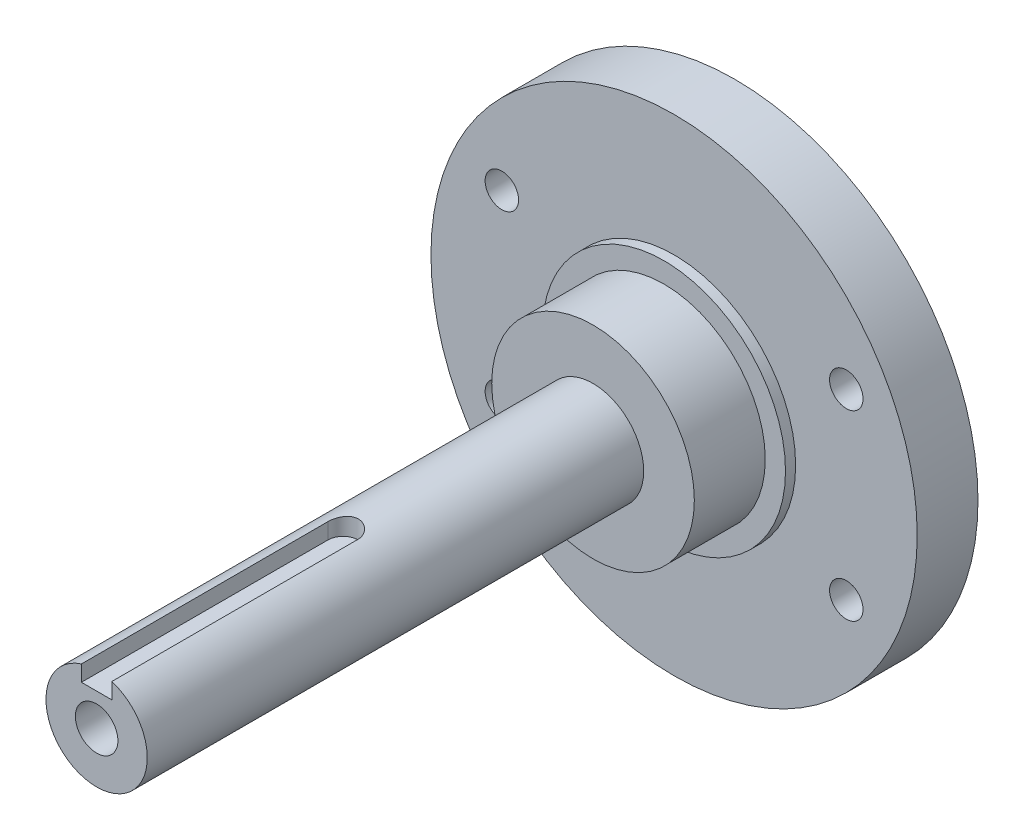
ISO-10303-21;
HEADER;
FILE_DESCRIPTION(('STEP AP214'),'2;1');
FILE_NAME('part.step','',(''),(''),'','','');
FILE_SCHEMA(('AUTOMOTIVE_DESIGN { 1 0 10303 214 1 1 1 1 }'));
ENDSEC;
DATA;
#1=APPLICATION_CONTEXT('core data for automotive mechanical design processes');
#2=APPLICATION_PROTOCOL_DEFINITION('international standard','automotive_design',2000,#1);
#3=PRODUCT_CONTEXT('',#1,'mechanical');
#4=PRODUCT('Part','Part','',(#3));
#5=PRODUCT_RELATED_PRODUCT_CATEGORY('part','',(#4));
#6=PRODUCT_DEFINITION_FORMATION('','',#4);
#7=PRODUCT_DEFINITION_CONTEXT('part definition',#1,'design');
#8=PRODUCT_DEFINITION('design','',#6,#7);
#9=PRODUCT_DEFINITION_SHAPE('','',#8);
#10=(LENGTH_UNIT() NAMED_UNIT(*) SI_UNIT(.MILLI.,.METRE.));
#11=(NAMED_UNIT(*) PLANE_ANGLE_UNIT() SI_UNIT($,.RADIAN.));
#12=(NAMED_UNIT(*) SI_UNIT($,.STERADIAN.) SOLID_ANGLE_UNIT());
#13=UNCERTAINTY_MEASURE_WITH_UNIT(LENGTH_MEASURE(1.E-05),#10,'distance_accuracy_value','');
#14=(GEOMETRIC_REPRESENTATION_CONTEXT(3) GLOBAL_UNCERTAINTY_ASSIGNED_CONTEXT((#13)) GLOBAL_UNIT_ASSIGNED_CONTEXT((#10,
#11,#12)) REPRESENTATION_CONTEXT('',''));
#15=CARTESIAN_POINT('',(0.,0.,0.));
#16=DIRECTION('',(0.,0.,1.));
#17=DIRECTION('',(1.,0.,0.));
#18=AXIS2_PLACEMENT_3D('',#15,#16,#17);
#19=CARTESIAN_POINT('',(0.,0.,1.));
#20=DIRECTION('',(0.,0.,-1.));
#21=DIRECTION('',(-1.,0.,0.));
#22=AXIS2_PLACEMENT_3D('',#19,#20,#21);
#23=CYLINDRICAL_SURFACE('',#22,12.);
#24=CARTESIAN_POINT('',(0.,0.,1.));
#25=DIRECTION('',(0.,0.,1.));
#26=DIRECTION('',(1.,0.,0.));
#27=AXIS2_PLACEMENT_3D('',#24,#25,#26);
#28=CIRCLE('',#27,12.);
#29=CARTESIAN_POINT('',(12.,0.,1.));
#30=VERTEX_POINT('',#29);
#31=EDGE_CURVE('E82',#30,#30,#28,.T.);
#32=ORIENTED_EDGE('',*,*,#31,.F.);
#33=EDGE_LOOP('',(#32));
#34=FACE_BOUND('',#33,.T.);
#35=CARTESIAN_POINT('',(0.,0.,0.));
#36=DIRECTION('',(0.,0.,1.));
#37=DIRECTION('',(1.,0.,0.));
#38=AXIS2_PLACEMENT_3D('',#35,#36,#37);
#39=CIRCLE('',#38,12.);
#40=CARTESIAN_POINT('',(12.,0.,0.));
#41=VERTEX_POINT('',#40);
#42=EDGE_CURVE('E144',#41,#41,#39,.T.);
#43=ORIENTED_EDGE('',*,*,#42,.T.);
#44=EDGE_LOOP('',(#43));
#45=FACE_BOUND('',#44,.T.);
#46=ADVANCED_FACE('F33',(#34,#45),#23,.T.);
#47=CARTESIAN_POINT('',(0.,0.,1.));
#48=DIRECTION('',(0.,0.,1.));
#49=DIRECTION('',(1.,0.,0.));
#50=AXIS2_PLACEMENT_3D('',#47,#48,#49);
#51=PLANE('',#50);
#52=CARTESIAN_POINT('',(0.,0.,1.));
#53=DIRECTION('',(0.,0.,1.));
#54=DIRECTION('',(1.,0.,0.));
#55=AXIS2_PLACEMENT_3D('',#52,#53,#54);
#56=CIRCLE('',#55,10.);
#57=CARTESIAN_POINT('',(9.99999999999999,0.,1.));
#58=VERTEX_POINT('',#57);
#59=EDGE_CURVE('E195',#58,#58,#56,.T.);
#60=ORIENTED_EDGE('',*,*,#59,.F.);
#61=EDGE_LOOP('',(#60));
#62=FACE_BOUND('',#61,.T.);
#63=ORIENTED_EDGE('',*,*,#31,.T.);
#64=EDGE_LOOP('',(#63));
#65=FACE_BOUND('',#64,.T.);
#66=ADVANCED_FACE('F132',(#62,#65),#51,.T.);
#67=CARTESIAN_POINT('',(0.,0.,-6.));
#68=DIRECTION('',(0.,0.,1.));
#69=DIRECTION('',(1.,0.,0.));
#70=AXIS2_PLACEMENT_3D('',#67,#68,#69);
#71=CYLINDRICAL_SURFACE('',#70,24.);
#72=CARTESIAN_POINT('',(0.,0.,-6.));
#73=DIRECTION('',(0.,0.,-1.));
#74=DIRECTION('',(-1.,0.,0.));
#75=AXIS2_PLACEMENT_3D('',#72,#73,#74);
#76=CIRCLE('',#75,24.);
#77=CARTESIAN_POINT('',(-24.,0.,-6.));
#78=VERTEX_POINT('',#77);
#79=EDGE_CURVE('E146',#78,#78,#76,.T.);
#80=ORIENTED_EDGE('',*,*,#79,.F.);
#81=EDGE_LOOP('',(#80));
#82=FACE_BOUND('',#81,.T.);
#83=CARTESIAN_POINT('',(0.,0.,0.));
#84=DIRECTION('',(0.,0.,-1.));
#85=DIRECTION('',(-1.,0.,0.));
#86=AXIS2_PLACEMENT_3D('',#83,#84,#85);
#87=CIRCLE('',#86,24.);
#88=CARTESIAN_POINT('',(-24.,0.,0.));
#89=VERTEX_POINT('',#88);
#90=EDGE_CURVE('E150',#89,#89,#87,.T.);
#91=ORIENTED_EDGE('',*,*,#90,.T.);
#92=EDGE_LOOP('',(#91));
#93=FACE_BOUND('',#92,.T.);
#94=ADVANCED_FACE('F137',(#82,#93),#71,.T.);
#95=CARTESIAN_POINT('',(0.,0.,-6.));
#96=DIRECTION('',(0.,0.,-1.));
#97=DIRECTION('',(-1.,0.,0.));
#98=AXIS2_PLACEMENT_3D('',#95,#96,#97);
#99=PLANE('',#98);
#100=CARTESIAN_POINT('',(17.,8.99999999999999,-6.));
#101=DIRECTION('',(0.,0.,-1.));
#102=DIRECTION('',(-1.,0.,0.));
#103=AXIS2_PLACEMENT_3D('',#100,#101,#102);
#104=CIRCLE('',#103,1.65);
#105=CARTESIAN_POINT('',(15.35,8.99999999999999,-6.));
#106=VERTEX_POINT('',#105);
#107=EDGE_CURVE('E176',#106,#106,#104,.T.);
#108=ORIENTED_EDGE('',*,*,#107,.F.);
#109=EDGE_LOOP('',(#108));
#110=FACE_BOUND('',#109,.T.);
#111=CARTESIAN_POINT('',(-17.,-9.,-6.));
#112=DIRECTION('',(0.,0.,-1.));
#113=DIRECTION('',(-1.,0.,0.));
#114=AXIS2_PLACEMENT_3D('',#111,#112,#113);
#115=CIRCLE('',#114,1.65);
#116=CARTESIAN_POINT('',(-18.65,-9.,-6.));
#117=VERTEX_POINT('',#116);
#118=EDGE_CURVE('E170',#117,#117,#115,.T.);
#119=ORIENTED_EDGE('',*,*,#118,.F.);
#120=EDGE_LOOP('',(#119));
#121=FACE_BOUND('',#120,.T.);
#122=CARTESIAN_POINT('',(-17.,9.,-6.));
#123=DIRECTION('',(0.,0.,-1.));
#124=DIRECTION('',(-1.,0.,0.));
#125=AXIS2_PLACEMENT_3D('',#122,#123,#124);
#126=CIRCLE('',#125,1.65);
#127=CARTESIAN_POINT('',(-18.65,9.,-6.));
#128=VERTEX_POINT('',#127);
#129=EDGE_CURVE('E164',#128,#128,#126,.T.);
#130=ORIENTED_EDGE('',*,*,#129,.F.);
#131=EDGE_LOOP('',(#130));
#132=FACE_BOUND('',#131,.T.);
#133=CARTESIAN_POINT('',(17.,-9.00000000000001,-6.));
#134=DIRECTION('',(0.,0.,-1.));
#135=DIRECTION('',(-1.,0.,0.));
#136=AXIS2_PLACEMENT_3D('',#133,#134,#135);
#137=CIRCLE('',#136,1.65);
#138=CARTESIAN_POINT('',(15.35,-9.00000000000001,-6.));
#139=VERTEX_POINT('',#138);
#140=EDGE_CURVE('E158',#139,#139,#137,.T.);
#141=ORIENTED_EDGE('',*,*,#140,.F.);
#142=EDGE_LOOP('',(#141));
#143=FACE_BOUND('',#142,.T.);
#144=ORIENTED_EDGE('',*,*,#79,.T.);
#145=EDGE_LOOP('',(#144));
#146=FACE_BOUND('',#145,.T.);
#147=ADVANCED_FACE('F270',(#110,#121,#132,#143,#146),#99,.T.);
#148=CARTESIAN_POINT('',(0.,0.,0.));
#149=DIRECTION('',(0.,0.,-1.));
#150=DIRECTION('',(-1.,0.,0.));
#151=AXIS2_PLACEMENT_3D('',#148,#149,#150);
#152=PLANE('',#151);
#153=CARTESIAN_POINT('',(17.,8.99999999999999,0.));
#154=DIRECTION('',(0.,0.,-1.));
#155=DIRECTION('',(-1.,0.,0.));
#156=AXIS2_PLACEMENT_3D('',#153,#154,#155);
#157=CIRCLE('',#156,1.65);
#158=CARTESIAN_POINT('',(15.35,8.99999999999999,0.));
#159=VERTEX_POINT('',#158);
#160=EDGE_CURVE('E173',#159,#159,#157,.T.);
#161=ORIENTED_EDGE('',*,*,#160,.T.);
#162=EDGE_LOOP('',(#161));
#163=FACE_BOUND('',#162,.T.);
#164=CARTESIAN_POINT('',(-17.,-9.,0.));
#165=DIRECTION('',(0.,0.,-1.));
#166=DIRECTION('',(-1.,0.,0.));
#167=AXIS2_PLACEMENT_3D('',#164,#165,#166);
#168=CIRCLE('',#167,1.65);
#169=CARTESIAN_POINT('',(-18.65,-9.,0.));
#170=VERTEX_POINT('',#169);
#171=EDGE_CURVE('E167',#170,#170,#168,.T.);
#172=ORIENTED_EDGE('',*,*,#171,.T.);
#173=EDGE_LOOP('',(#172));
#174=FACE_BOUND('',#173,.T.);
#175=CARTESIAN_POINT('',(-17.,9.,0.));
#176=DIRECTION('',(0.,0.,-1.));
#177=DIRECTION('',(-1.,0.,0.));
#178=AXIS2_PLACEMENT_3D('',#175,#176,#177);
#179=CIRCLE('',#178,1.65);
#180=CARTESIAN_POINT('',(-18.65,9.,0.));
#181=VERTEX_POINT('',#180);
#182=EDGE_CURVE('E161',#181,#181,#179,.T.);
#183=ORIENTED_EDGE('',*,*,#182,.T.);
#184=EDGE_LOOP('',(#183));
#185=FACE_BOUND('',#184,.T.);
#186=CARTESIAN_POINT('',(17.,-9.00000000000001,0.));
#187=DIRECTION('',(0.,0.,-1.));
#188=DIRECTION('',(-1.,0.,0.));
#189=AXIS2_PLACEMENT_3D('',#186,#187,#188);
#190=CIRCLE('',#189,1.65);
#191=CARTESIAN_POINT('',(15.35,-9.00000000000001,0.));
#192=VERTEX_POINT('',#191);
#193=EDGE_CURVE('E154',#192,#192,#190,.T.);
#194=ORIENTED_EDGE('',*,*,#193,.T.);
#195=EDGE_LOOP('',(#194));
#196=FACE_BOUND('',#195,.T.);
#197=ORIENTED_EDGE('',*,*,#42,.F.);
#198=EDGE_LOOP('',(#197));
#199=FACE_BOUND('',#198,.T.);
#200=ORIENTED_EDGE('',*,*,#90,.F.);
#201=EDGE_LOOP('',(#200));
#202=FACE_BOUND('',#201,.T.);
#203=ADVANCED_FACE('F277',(#163,#174,#185,#196,#199,#202),#152,.F.);
#204=CARTESIAN_POINT('',(17.,-9.00000000000001,-6.));
#205=DIRECTION('',(0.,0.,-1.));
#206=DIRECTION('',(-1.,0.,0.));
#207=AXIS2_PLACEMENT_3D('',#204,#205,#206);
#208=CYLINDRICAL_SURFACE('',#207,1.65);
#209=ORIENTED_EDGE('',*,*,#193,.F.);
#210=EDGE_LOOP('',(#209));
#211=FACE_BOUND('',#210,.T.);
#212=ORIENTED_EDGE('',*,*,#140,.T.);
#213=EDGE_LOOP('',(#212));
#214=FACE_BOUND('',#213,.T.);
#215=ADVANCED_FACE('F285',(#211,#214),#208,.F.);
#216=CARTESIAN_POINT('',(-17.,9.,-6.));
#217=DIRECTION('',(0.,0.,-1.));
#218=DIRECTION('',(-1.,0.,0.));
#219=AXIS2_PLACEMENT_3D('',#216,#217,#218);
#220=CYLINDRICAL_SURFACE('',#219,1.65);
#221=ORIENTED_EDGE('',*,*,#182,.F.);
#222=EDGE_LOOP('',(#221));
#223=FACE_BOUND('',#222,.T.);
#224=ORIENTED_EDGE('',*,*,#129,.T.);
#225=EDGE_LOOP('',(#224));
#226=FACE_BOUND('',#225,.T.);
#227=ADVANCED_FACE('F293',(#223,#226),#220,.F.);
#228=CARTESIAN_POINT('',(-17.,-9.,-6.));
#229=DIRECTION('',(0.,0.,-1.));
#230=DIRECTION('',(-1.,0.,0.));
#231=AXIS2_PLACEMENT_3D('',#228,#229,#230);
#232=CYLINDRICAL_SURFACE('',#231,1.65);
#233=ORIENTED_EDGE('',*,*,#171,.F.);
#234=EDGE_LOOP('',(#233));
#235=FACE_BOUND('',#234,.T.);
#236=ORIENTED_EDGE('',*,*,#118,.T.);
#237=EDGE_LOOP('',(#236));
#238=FACE_BOUND('',#237,.T.);
#239=ADVANCED_FACE('F301',(#235,#238),#232,.F.);
#240=CARTESIAN_POINT('',(17.,8.99999999999999,-6.));
#241=DIRECTION('',(0.,0.,-1.));
#242=DIRECTION('',(-1.,0.,0.));
#243=AXIS2_PLACEMENT_3D('',#240,#241,#242);
#244=CYLINDRICAL_SURFACE('',#243,1.65);
#245=ORIENTED_EDGE('',*,*,#160,.F.);
#246=EDGE_LOOP('',(#245));
#247=FACE_BOUND('',#246,.T.);
#248=ORIENTED_EDGE('',*,*,#107,.T.);
#249=EDGE_LOOP('',(#248));
#250=FACE_BOUND('',#249,.T.);
#251=ADVANCED_FACE('F213',(#247,#250),#244,.F.);
#252=CARTESIAN_POINT('',(0.,0.,7.99999999999999));
#253=DIRECTION('',(0.,0.,-1.));
#254=DIRECTION('',(-1.,0.,0.));
#255=AXIS2_PLACEMENT_3D('',#252,#253,#254);
#256=CYLINDRICAL_SURFACE('',#255,10.);
#257=CARTESIAN_POINT('',(0.,0.,7.99999999999999));
#258=DIRECTION('',(0.,0.,1.));
#259=DIRECTION('',(1.,0.,0.));
#260=AXIS2_PLACEMENT_3D('',#257,#258,#259);
#261=CIRCLE('',#260,10.);
#262=CARTESIAN_POINT('',(9.99999999999999,0.,7.99999999999999));
#263=VERTEX_POINT('',#262);
#264=EDGE_CURVE('E198',#263,#263,#261,.T.);
#265=ORIENTED_EDGE('',*,*,#264,.F.);
#266=EDGE_LOOP('',(#265));
#267=FACE_BOUND('',#266,.T.);
#268=ORIENTED_EDGE('',*,*,#59,.T.);
#269=EDGE_LOOP('',(#268));
#270=FACE_BOUND('',#269,.T.);
#271=ADVANCED_FACE('F208',(#267,#270),#256,.T.);
#272=CARTESIAN_POINT('',(0.,0.,7.99999999999999));
#273=DIRECTION('',(0.,0.,1.));
#274=DIRECTION('',(1.,0.,0.));
#275=AXIS2_PLACEMENT_3D('',#272,#273,#274);
#276=PLANE('',#275);
#277=CARTESIAN_POINT('',(0.,0.,7.99999999999999));
#278=DIRECTION('',(0.,0.,1.));
#279=DIRECTION('',(1.,0.,0.));
#280=AXIS2_PLACEMENT_3D('',#277,#278,#279);
#281=CIRCLE('',#280,5.);
#282=CARTESIAN_POINT('',(5.,0.,7.99999999999999));
#283=VERTEX_POINT('',#282);
#284=EDGE_CURVE('E36',#283,#283,#281,.T.);
#285=ORIENTED_EDGE('',*,*,#284,.F.);
#286=EDGE_LOOP('',(#285));
#287=FACE_BOUND('',#286,.T.);
#288=ORIENTED_EDGE('',*,*,#264,.T.);
#289=EDGE_LOOP('',(#288));
#290=FACE_BOUND('',#289,.T.);
#291=ADVANCED_FACE('F123',(#287,#290),#276,.T.);
#292=CARTESIAN_POINT('',(0.,0.,37.));
#293=DIRECTION('',(0.,0.,1.));
#294=DIRECTION('',(1.,0.,0.));
#295=AXIS2_PLACEMENT_3D('',#292,#293,#294);
#296=CONICAL_SURFACE('',#295,2.1,1.02974425867665);
#297=CARTESIAN_POINT('',(0.,0.,35.7381927000421));
#298=VERTEX_POINT('',#297);
#299=VERTEX_LOOP('',#298);
#300=FACE_BOUND('',#299,.T.);
#301=CARTESIAN_POINT('',(0.,0.,37.));
#302=DIRECTION('',(0.,0.,1.));
#303=DIRECTION('',(1.,0.,0.));
#304=AXIS2_PLACEMENT_3D('',#301,#302,#303);
#305=CIRCLE('',#304,2.1);
#306=CARTESIAN_POINT('',(2.1,0.,37.));
#307=VERTEX_POINT('',#306);
#308=EDGE_CURVE('E180',#307,#307,#305,.T.);
#309=ORIENTED_EDGE('',*,*,#308,.T.);
#310=EDGE_LOOP('',(#309));
#311=FACE_BOUND('',#310,.T.);
#312=ADVANCED_FACE('F120',(#300,#311),#296,.F.);
#313=CARTESIAN_POINT('',(0.,0.,57.));
#314=DIRECTION('',(0.,0.,1.));
#315=DIRECTION('',(1.,0.,0.));
#316=AXIS2_PLACEMENT_3D('',#313,#314,#315);
#317=CYLINDRICAL_SURFACE('',#316,2.1);
#318=ORIENTED_EDGE('',*,*,#308,.F.);
#319=EDGE_LOOP('',(#318));
#320=FACE_BOUND('',#319,.T.);
#321=CARTESIAN_POINT('',(0.,0.,57.));
#322=DIRECTION('',(0.,0.,1.));
#323=DIRECTION('',(1.,0.,0.));
#324=AXIS2_PLACEMENT_3D('',#321,#322,#323);
#325=CIRCLE('',#324,2.1);
#326=CARTESIAN_POINT('',(2.1,0.,57.));
#327=VERTEX_POINT('',#326);
#328=EDGE_CURVE('E183',#327,#327,#325,.T.);
#329=ORIENTED_EDGE('',*,*,#328,.T.);
#330=EDGE_LOOP('',(#329));
#331=FACE_BOUND('',#330,.T.);
#332=ADVANCED_FACE('F117',(#320,#331),#317,.F.);
#333=CARTESIAN_POINT('',(0.,3.2,57.));
#334=DIRECTION('',(0.,1.,0.));
#335=DIRECTION('',(0.,0.,1.));
#336=AXIS2_PLACEMENT_3D('',#333,#334,#335);
#337=PLANE('',#336);
#338=DIRECTION('',(0.,0.,-1.));
#339=VECTOR('',#338,1.);
#340=CARTESIAN_POINT('',(1.5,3.2,57.));
#341=LINE('',#340,#339);
#342=CARTESIAN_POINT('',(1.5,3.2,57.));
#343=VERTEX_POINT('',#342);
#344=CARTESIAN_POINT('',(1.5,3.2,32.6699517924318));
#345=VERTEX_POINT('',#344);
#346=EDGE_CURVE('E76',#343,#345,#341,.T.);
#347=ORIENTED_EDGE('',*,*,#346,.T.);
#348=CARTESIAN_POINT('',(0.,3.2,32.6699517924318));
#349=DIRECTION('',(0.,1.,0.));
#350=DIRECTION('',(0.,0.,1.));
#351=AXIS2_PLACEMENT_3D('',#348,#349,#350);
#352=CIRCLE('',#351,1.5);
#353=CARTESIAN_POINT('',(-1.5,3.2,32.6699517924318));
#354=VERTEX_POINT('',#353);
#355=EDGE_CURVE('E89',#345,#354,#352,.T.);
#356=ORIENTED_EDGE('',*,*,#355,.T.);
#357=DIRECTION('',(0.,0.,1.));
#358=VECTOR('',#357,1.);
#359=CARTESIAN_POINT('',(-1.5,3.2,57.));
#360=LINE('',#359,#358);
#361=CARTESIAN_POINT('',(-1.5,3.2,57.));
#362=VERTEX_POINT('',#361);
#363=EDGE_CURVE('E48',#354,#362,#360,.T.);
#364=ORIENTED_EDGE('',*,*,#363,.T.);
#365=DIRECTION('',(-1.,0.,0.));
#366=VECTOR('',#365,1.);
#367=CARTESIAN_POINT('',(0.,3.2,57.));
#368=LINE('',#367,#366);
#369=EDGE_CURVE('E73',#343,#362,#368,.T.);
#370=ORIENTED_EDGE('',*,*,#369,.F.);
#371=EDGE_LOOP('',(#347,#356,#364,#370));
#372=FACE_BOUND('',#371,.T.);
#373=ADVANCED_FACE('F75',(#372),#337,.T.);
#374=CARTESIAN_POINT('',(0.,24.,32.6699517924318));
#375=DIRECTION('',(0.,-1.,0.));
#376=DIRECTION('',(0.,0.,-1.));
#377=AXIS2_PLACEMENT_3D('',#374,#375,#376);
#378=CYLINDRICAL_SURFACE('',#377,1.5);
#379=CARTESIAN_POINT('',(1.5,4.76969600708473,32.6699517924318));
#380=CARTESIAN_POINT('',(1.50000085357071,4.76969249084934,32.6287723995238));
#381=CARTESIAN_POINT('',(1.49830317083428,4.77022997000129,32.5876137493057));
#382=CARTESIAN_POINT('',(1.49153785660317,4.77235095109999,32.5056106303362));
#383=CARTESIAN_POINT('',(1.48647098275841,4.77393421787376,32.4647660930369));
#384=CARTESIAN_POINT('',(1.46630203689311,4.78018490618873,32.3433612514772));
#385=CARTESIAN_POINT('',(1.44623120413662,4.78635370384275,32.2636454020154));
#386=CARTESIAN_POINT('',(1.39353102315626,4.80195952113208,32.108916214046));
#387=CARTESIAN_POINT('',(1.36090607068203,4.81139539670393,32.0339012402337));
#388=CARTESIAN_POINT('',(1.28407841117656,4.83246571212052,31.8903551108342));
#389=CARTESIAN_POINT('',(1.23987031651226,4.84410117434933,31.8218269927034));
#390=CARTESIAN_POINT('',(1.13964850658326,4.86866835244721,31.6910857364348));
#391=CARTESIAN_POINT('',(1.08333433465208,4.88162755412974,31.6291081320884));
#392=CARTESIAN_POINT('',(0.961138919873354,4.90714811559049,31.5153162085319));
#393=CARTESIAN_POINT('',(0.895256063916348,4.91970940785249,31.4635036064288));
#394=CARTESIAN_POINT('',(0.754109921315429,4.94333239727705,31.3704880221133));
#395=CARTESIAN_POINT('',(0.678680819336258,4.95435770971354,31.3295266121339));
#396=CARTESIAN_POINT('',(0.521621185505773,4.97334469846208,31.2609633808137));
#397=CARTESIAN_POINT('',(0.439992259012925,4.98130716463903,31.2333581146375));
#398=CARTESIAN_POINT('',(0.275324697874876,4.99307639935002,31.1930719933298));
#399=CARTESIAN_POINT('',(0.192393125294252,4.99699549276993,31.1799869344621));
#400=CARTESIAN_POINT('',(0.0254235719980808,5.00063202022426,31.1678344510686));
#401=CARTESIAN_POINT('',(-0.0586141962423632,5.00035024971471,31.1687643727317));
#402=CARTESIAN_POINT('',(-0.222571599946017,4.99569602566267,31.1843447011908));
#403=CARTESIAN_POINT('',(-0.302537145464642,4.99145415509187,31.1985571374105));
#404=CARTESIAN_POINT('',(-0.458890052102026,4.9795151369998,31.2395834276699));
#405=CARTESIAN_POINT('',(-0.535277225531998,4.97181780846028,31.2663979418878));
#406=CARTESIAN_POINT('',(-0.683347815892216,4.95365214926145,31.3321640140783));
#407=CARTESIAN_POINT('',(-0.754966006044142,4.94315255692525,31.3712534367888));
#408=CARTESIAN_POINT('',(-0.89076552957442,4.92049624651755,31.4603503824801));
#409=CARTESIAN_POINT('',(-0.954945191614595,4.90833915735884,31.5103603519106));
#410=CARTESIAN_POINT('',(-1.07665450541275,4.88311673571409,31.6221437805153));
#411=CARTESIAN_POINT('',(-1.13383351478034,4.87003445449554,31.6842956561926));
#412=CARTESIAN_POINT('',(-1.23706769492487,4.84484215114658,31.8174492158597));
#413=CARTESIAN_POINT('',(-1.28311962013078,4.83273241337565,31.8884534727973));
#414=CARTESIAN_POINT('',(-1.36316407240863,4.81077228795653,32.0382327208811));
#415=CARTESIAN_POINT('',(-1.39703006341135,4.80094596245948,32.1170789720252));
#416=CARTESIAN_POINT('',(-1.45085886004699,4.78495663653201,32.2796762964136));
#417=CARTESIAN_POINT('',(-1.47084293218035,4.77878803475875,32.3634196531462));
#418=CARTESIAN_POINT('',(-1.4890120359008,4.77314032325006,32.484946681502));
#419=CARTESIAN_POINT('',(-1.49313202989009,4.77185156275267,32.5218425266114));
#420=CARTESIAN_POINT('',(-1.49862355614854,4.77012928611782,32.5958032715313));
#421=CARTESIAN_POINT('',(-1.49999912968269,4.76969451246644,32.6328678420957));
#422=CARTESIAN_POINT('',(-1.5,4.76969600708473,32.6699517924318));
#423=B_SPLINE_CURVE_WITH_KNOTS('',3,(#379,#380,#381,#382,#383,#384,#385,#386,#387,#388,#389,
#390,#391,#392,#393,#394,#395,#396,#397,#398,#399,#400,#401,#402,#403,#404,#405,#406,#407,#408,
#409,#410,#411,#412,#413,#414,#415,#416,#417,#418,#419,#420,#421,#422),.UNSPECIFIED.,.F.,.F.,(4,
2,2,2,2,2,2,2,2,2,2,2,2,2,2,2,2,2,2,2,2,4),(0.,0.123459071219744,0.246890388853047,
0.492911349615212,0.738846245884322,0.984895736828089,1.23795510798803,1.49105719006936,
1.74939356197455,2.00766326783256,2.25854751319802,2.5093842528947,2.75223130012966,
2.99509107067836,3.2407824256273,3.48652887757005,3.74172568310981,3.99699683536778,
4.25484698071527,4.51230123440207,4.62365084745809,4.73483637253615),.UNSPECIFIED.);
#424=CARTESIAN_POINT('',(1.5,4.76969600708473,32.6699517924318));
#425=VERTEX_POINT('',#424);
#426=CARTESIAN_POINT('',(-1.5,4.76969600708473,32.6699517924318));
#427=VERTEX_POINT('',#426);
#428=EDGE_CURVE('E11',#425,#427,#423,.T.);
#429=ORIENTED_EDGE('',*,*,#428,.T.);
#430=DIRECTION('',(0.,-1.,0.));
#431=VECTOR('',#430,1.);
#432=CARTESIAN_POINT('',(-1.5,24.,32.6699517924318));
#433=LINE('',#432,#431);
#434=EDGE_CURVE('E191',#427,#354,#433,.T.);
#435=ORIENTED_EDGE('',*,*,#434,.T.);
#436=ORIENTED_EDGE('',*,*,#355,.F.);
#437=DIRECTION('',(0.,-1.,0.));
#438=VECTOR('',#437,1.);
#439=CARTESIAN_POINT('',(1.5,24.,32.6699517924318));
#440=LINE('',#439,#438);
#441=EDGE_CURVE('E88',#425,#345,#440,.T.);
#442=ORIENTED_EDGE('',*,*,#441,.F.);
#443=EDGE_LOOP('',(#429,#435,#436,#442));
#444=FACE_BOUND('',#443,.T.);
#445=ADVANCED_FACE('F107',(#444),#378,.F.);
#446=CARTESIAN_POINT('',(-1.5,24.,57.));
#447=DIRECTION('',(1.,0.,0.));
#448=DIRECTION('',(0.,0.,-1.));
#449=AXIS2_PLACEMENT_3D('',#446,#447,#448);
#450=PLANE('',#449);
#451=DIRECTION('',(0.,0.,-1.));
#452=VECTOR('',#451,1.);
#453=CARTESIAN_POINT('',(-1.5,4.76969600708473,57.));
#454=LINE('',#453,#452);
#455=CARTESIAN_POINT('',(-1.5,4.76969600708473,57.));
#456=VERTEX_POINT('',#455);
#457=EDGE_CURVE('E188',#427,#456,#454,.F.);
#458=ORIENTED_EDGE('',*,*,#457,.T.);
#459=DIRECTION('',(0.,1.,0.));
#460=VECTOR('',#459,1.);
#461=CARTESIAN_POINT('',(-1.5,0.,57.));
#462=LINE('',#461,#460);
#463=EDGE_CURVE('E81',#362,#456,#462,.T.);
#464=ORIENTED_EDGE('',*,*,#463,.F.);
#465=ORIENTED_EDGE('',*,*,#363,.F.);
#466=ORIENTED_EDGE('',*,*,#434,.F.);
#467=EDGE_LOOP('',(#458,#464,#465,#466));
#468=FACE_BOUND('',#467,.T.);
#469=ADVANCED_FACE('F112',(#468),#450,.T.);
#470=CARTESIAN_POINT('',(0.,0.,57.));
#471=DIRECTION('',(0.,0.,1.));
#472=DIRECTION('',(1.,0.,0.));
#473=AXIS2_PLACEMENT_3D('',#470,#471,#472);
#474=PLANE('',#473);
#475=ORIENTED_EDGE('',*,*,#328,.F.);
#476=EDGE_LOOP('',(#475));
#477=FACE_BOUND('',#476,.T.);
#478=CARTESIAN_POINT('',(0.,0.,57.));
#479=DIRECTION('',(0.,0.,1.));
#480=DIRECTION('',(1.,0.,0.));
#481=AXIS2_PLACEMENT_3D('',#478,#479,#480);
#482=CIRCLE('',#481,5.);
#483=CARTESIAN_POINT('',(1.5,4.76969600708473,57.));
#484=VERTEX_POINT('',#483);
#485=EDGE_CURVE('E94',#456,#484,#482,.T.);
#486=ORIENTED_EDGE('',*,*,#485,.T.);
#487=DIRECTION('',(0.,-1.,0.));
#488=VECTOR('',#487,1.);
#489=CARTESIAN_POINT('',(1.5,0.,57.));
#490=LINE('',#489,#488);
#491=EDGE_CURVE('E41',#484,#343,#490,.T.);
#492=ORIENTED_EDGE('',*,*,#491,.T.);
#493=ORIENTED_EDGE('',*,*,#369,.T.);
#494=ORIENTED_EDGE('',*,*,#463,.T.);
#495=EDGE_LOOP('',(#486,#492,#493,#494));
#496=FACE_BOUND('',#495,.T.);
#497=ADVANCED_FACE('F92',(#477,#496),#474,.T.);
#498=CARTESIAN_POINT('',(1.5,24.,57.));
#499=DIRECTION('',(-1.,0.,0.));
#500=DIRECTION('',(0.,0.,1.));
#501=AXIS2_PLACEMENT_3D('',#498,#499,#500);
#502=PLANE('',#501);
#503=DIRECTION('',(0.,0.,-1.));
#504=VECTOR('',#503,1.);
#505=CARTESIAN_POINT('',(1.5,4.76969600708473,57.));
#506=LINE('',#505,#504);
#507=EDGE_CURVE('E186',#484,#425,#506,.T.);
#508=ORIENTED_EDGE('',*,*,#507,.T.);
#509=ORIENTED_EDGE('',*,*,#441,.T.);
#510=ORIENTED_EDGE('',*,*,#346,.F.);
#511=ORIENTED_EDGE('',*,*,#491,.F.);
#512=EDGE_LOOP('',(#508,#509,#510,#511));
#513=FACE_BOUND('',#512,.T.);
#514=ADVANCED_FACE('F85',(#513),#502,.T.);
#515=CARTESIAN_POINT('',(0.,0.,57.));
#516=DIRECTION('',(0.,0.,-1.));
#517=DIRECTION('',(-1.,0.,0.));
#518=AXIS2_PLACEMENT_3D('',#515,#516,#517);
#519=CYLINDRICAL_SURFACE('',#518,5.);
#520=ORIENTED_EDGE('',*,*,#284,.T.);
#521=EDGE_LOOP('',(#520));
#522=FACE_BOUND('',#521,.T.);
#523=ORIENTED_EDGE('',*,*,#507,.F.);
#524=ORIENTED_EDGE('',*,*,#485,.F.);
#525=ORIENTED_EDGE('',*,*,#457,.F.);
#526=ORIENTED_EDGE('',*,*,#428,.F.);
#527=EDGE_LOOP('',(#523,#524,#525,#526));
#528=FACE_BOUND('',#527,.T.);
#529=ADVANCED_FACE('F103',(#522,#528),#519,.T.);
#530=CLOSED_SHELL('',(#46,#66,#94,#147,#203,#215,#227,#239,#251,#271,#291,#312,#332,#373,#445,
#469,#497,#514,#529));
#531=MANIFOLD_SOLID_BREP('B2',#530);
#532=ADVANCED_BREP_SHAPE_REPRESENTATION('',(#18,#531),#14);
#533=SHAPE_DEFINITION_REPRESENTATION(#9,#532);
ENDSEC;
END-ISO-10303-21;
